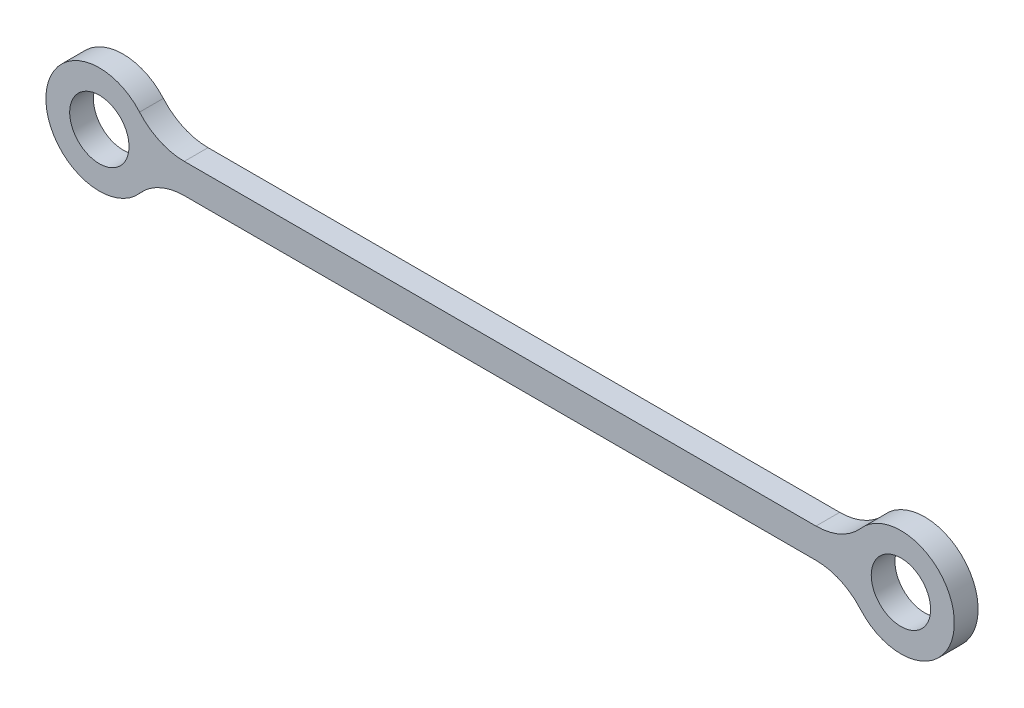
ISO-10303-21;
HEADER;
FILE_DESCRIPTION(('STEP AP214'),'2;1');
FILE_NAME('part.step','',(''),(''),'','','');
FILE_SCHEMA(('AUTOMOTIVE_DESIGN { 1 0 10303 214 1 1 1 1 }'));
ENDSEC;
DATA;
#1=APPLICATION_CONTEXT('core data for automotive mechanical design processes');
#2=APPLICATION_PROTOCOL_DEFINITION('international standard','automotive_design',2000,#1);
#3=PRODUCT_CONTEXT('',#1,'mechanical');
#4=PRODUCT('Part','Part','',(#3));
#5=PRODUCT_RELATED_PRODUCT_CATEGORY('part','',(#4));
#6=PRODUCT_DEFINITION_FORMATION('','',#4);
#7=PRODUCT_DEFINITION_CONTEXT('part definition',#1,'design');
#8=PRODUCT_DEFINITION('design','',#6,#7);
#9=PRODUCT_DEFINITION_SHAPE('','',#8);
#10=(LENGTH_UNIT() NAMED_UNIT(*) SI_UNIT(.MILLI.,.METRE.));
#11=(NAMED_UNIT(*) PLANE_ANGLE_UNIT() SI_UNIT($,.RADIAN.));
#12=(NAMED_UNIT(*) SI_UNIT($,.STERADIAN.) SOLID_ANGLE_UNIT());
#13=UNCERTAINTY_MEASURE_WITH_UNIT(LENGTH_MEASURE(1.E-05),#10,'distance_accuracy_value','');
#14=(GEOMETRIC_REPRESENTATION_CONTEXT(3) GLOBAL_UNCERTAINTY_ASSIGNED_CONTEXT((#13)) GLOBAL_UNIT_ASSIGNED_CONTEXT((#10,
#11,#12)) REPRESENTATION_CONTEXT('',''));
#15=CARTESIAN_POINT('',(0.,0.,0.));
#16=DIRECTION('',(0.,0.,1.));
#17=DIRECTION('',(1.,0.,0.));
#18=AXIS2_PLACEMENT_3D('',#15,#16,#17);
#19=CARTESIAN_POINT('',(-34.4856909477234,-12.5,0.));
#20=DIRECTION('',(0.,0.,-1.));
#21=DIRECTION('',(-1.,0.,0.));
#22=AXIS2_PLACEMENT_3D('',#19,#20,#21);
#23=PLANE('',#22);
#24=CARTESIAN_POINT('',(86.2052210310225,0.,0.));
#25=DIRECTION('',(0.,0.,-1.));
#26=DIRECTION('',(-1.,0.,0.));
#27=AXIS2_PLACEMENT_3D('',#24,#25,#26);
#28=CIRCLE('',#27,5.);
#29=CARTESIAN_POINT('',(81.2052210310225,0.,0.));
#30=VERTEX_POINT('',#29);
#31=EDGE_CURVE('E130',#30,#30,#28,.F.);
#32=ORIENTED_EDGE('',*,*,#31,.T.);
#33=EDGE_LOOP('',(#32));
#34=FACE_BOUND('',#33,.T.);
#35=CARTESIAN_POINT('',(71.8961330097683,-12.5,0.));
#36=DIRECTION('',(0.,0.,-1.));
#37=DIRECTION('',(-1.,0.,0.));
#38=AXIS2_PLACEMENT_3D('',#35,#36,#37);
#39=CIRCLE('',#38,9.99999999999999);
#40=CARTESIAN_POINT('',(79.4272319683231,-5.92105263157895,0.));
#41=VERTEX_POINT('',#40);
#42=CARTESIAN_POINT('',(71.8961330097683,-2.5,0.));
#43=VERTEX_POINT('',#42);
#44=EDGE_CURVE('E134',#41,#43,#39,.F.);
#45=ORIENTED_EDGE('',*,*,#44,.T.);
#46=DIRECTION('',(-1.,0.,0.));
#47=VECTOR('',#46,1.);
#48=CARTESIAN_POINT('',(-34.4856909477234,-2.5,0.));
#49=LINE('',#48,#47);
#50=CARTESIAN_POINT('',(-34.4856909477234,-2.5,0.));
#51=VERTEX_POINT('',#50);
#52=EDGE_CURVE('E105',#43,#51,#49,.T.);
#53=ORIENTED_EDGE('',*,*,#52,.T.);
#54=CARTESIAN_POINT('',(-34.4856909477234,-12.5,0.));
#55=DIRECTION('',(0.,0.,-1.));
#56=DIRECTION('',(-1.,0.,0.));
#57=AXIS2_PLACEMENT_3D('',#54,#55,#56);
#58=CIRCLE('',#57,10.);
#59=CARTESIAN_POINT('',(-42.0167899062782,-5.92105263157895,0.));
#60=VERTEX_POINT('',#59);
#61=EDGE_CURVE('E85',#51,#60,#58,.F.);
#62=ORIENTED_EDGE('',*,*,#61,.T.);
#63=CARTESIAN_POINT('',(-48.7947789689775,0.,0.));
#64=DIRECTION('',(0.,0.,-1.));
#65=DIRECTION('',(-1.,0.,0.));
#66=AXIS2_PLACEMENT_3D('',#63,#64,#65);
#67=CIRCLE('',#66,8.99999999999999);
#68=CARTESIAN_POINT('',(-42.0167899062782,5.92105263157895,0.));
#69=VERTEX_POINT('',#68);
#70=EDGE_CURVE('E80',#69,#60,#67,.F.);
#71=ORIENTED_EDGE('',*,*,#70,.F.);
#72=CARTESIAN_POINT('',(-34.4856909477234,12.5,0.));
#73=DIRECTION('',(0.,0.,-1.));
#74=DIRECTION('',(-1.,0.,0.));
#75=AXIS2_PLACEMENT_3D('',#72,#73,#74);
#76=CIRCLE('',#75,10.);
#77=CARTESIAN_POINT('',(-34.4856909477234,2.5,0.));
#78=VERTEX_POINT('',#77);
#79=EDGE_CURVE('E83',#69,#78,#76,.F.);
#80=ORIENTED_EDGE('',*,*,#79,.T.);
#81=DIRECTION('',(1.,0.,0.));
#82=VECTOR('',#81,1.);
#83=CARTESIAN_POINT('',(-34.4856909477234,2.5,0.));
#84=LINE('',#83,#82);
#85=CARTESIAN_POINT('',(71.8961330097682,2.49999999999998,0.));
#86=VERTEX_POINT('',#85);
#87=EDGE_CURVE('E109',#78,#86,#84,.T.);
#88=ORIENTED_EDGE('',*,*,#87,.T.);
#89=CARTESIAN_POINT('',(71.8961330097682,12.5,0.));
#90=DIRECTION('',(0.,0.,-1.));
#91=DIRECTION('',(-1.,0.,0.));
#92=AXIS2_PLACEMENT_3D('',#89,#90,#91);
#93=CIRCLE('',#92,10.);
#94=CARTESIAN_POINT('',(79.4272319683231,5.92105263157894,0.));
#95=VERTEX_POINT('',#94);
#96=EDGE_CURVE('E140',#86,#95,#93,.F.);
#97=ORIENTED_EDGE('',*,*,#96,.T.);
#98=CARTESIAN_POINT('',(86.2052210310225,0.,0.));
#99=DIRECTION('',(0.,0.,-1.));
#100=DIRECTION('',(-1.,0.,0.));
#101=AXIS2_PLACEMENT_3D('',#98,#99,#100);
#102=CIRCLE('',#101,8.99999999999999);
#103=EDGE_CURVE('E137',#41,#95,#102,.F.);
#104=ORIENTED_EDGE('',*,*,#103,.F.);
#105=EDGE_LOOP('',(#45,#53,#62,#71,#80,#88,#97,#104));
#106=FACE_BOUND('',#105,.T.);
#107=CARTESIAN_POINT('',(-48.7947789689775,0.,0.));
#108=DIRECTION('',(0.,0.,-1.));
#109=DIRECTION('',(-1.,0.,0.));
#110=AXIS2_PLACEMENT_3D('',#107,#108,#109);
#111=CIRCLE('',#110,5.);
#112=CARTESIAN_POINT('',(-53.7947789689775,0.,0.));
#113=VERTEX_POINT('',#112);
#114=EDGE_CURVE('E20',#113,#113,#111,.F.);
#115=ORIENTED_EDGE('',*,*,#114,.T.);
#116=EDGE_LOOP('',(#115));
#117=FACE_BOUND('',#116,.T.);
#118=ADVANCED_FACE('F17',(#34,#106,#117),#23,.T.);
#119=CARTESIAN_POINT('',(-48.7947789689775,0.,4.));
#120=DIRECTION('',(0.,0.,-1.));
#121=DIRECTION('',(-1.,0.,0.));
#122=AXIS2_PLACEMENT_3D('',#119,#120,#121);
#123=CYLINDRICAL_SURFACE('',#122,5.);
#124=ORIENTED_EDGE('',*,*,#114,.F.);
#125=EDGE_LOOP('',(#124));
#126=FACE_BOUND('',#125,.T.);
#127=CARTESIAN_POINT('',(-48.7947789689775,0.,4.));
#128=DIRECTION('',(0.,0.,-1.));
#129=DIRECTION('',(-1.,0.,0.));
#130=AXIS2_PLACEMENT_3D('',#127,#128,#129);
#131=CIRCLE('',#130,5.);
#132=CARTESIAN_POINT('',(-53.7947789689775,0.,4.));
#133=VERTEX_POINT('',#132);
#134=EDGE_CURVE('E127',#133,#133,#131,.F.);
#135=ORIENTED_EDGE('',*,*,#134,.T.);
#136=EDGE_LOOP('',(#135));
#137=FACE_BOUND('',#136,.T.);
#138=ADVANCED_FACE('F265',(#126,#137),#123,.F.);
#139=CARTESIAN_POINT('',(-48.7947789689775,0.,4.));
#140=DIRECTION('',(0.,0.,-1.));
#141=DIRECTION('',(-1.,0.,0.));
#142=AXIS2_PLACEMENT_3D('',#139,#140,#141);
#143=CYLINDRICAL_SURFACE('',#142,8.99999999999999);
#144=DIRECTION('',(0.,0.,-1.));
#145=VECTOR('',#144,1.);
#146=CARTESIAN_POINT('',(-42.0167899062782,5.92105263157895,4.));
#147=LINE('',#146,#145);
#148=CARTESIAN_POINT('',(-42.0167899062782,5.92105263157895,4.));
#149=VERTEX_POINT('',#148);
#150=EDGE_CURVE('E90',#149,#69,#147,.T.);
#151=ORIENTED_EDGE('',*,*,#150,.T.);
#152=ORIENTED_EDGE('',*,*,#70,.T.);
#153=DIRECTION('',(0.,0.,-1.));
#154=VECTOR('',#153,1.);
#155=CARTESIAN_POINT('',(-42.0167899062782,-5.92105263157895,4.));
#156=LINE('',#155,#154);
#157=CARTESIAN_POINT('',(-42.0167899062782,-5.92105263157895,4.));
#158=VERTEX_POINT('',#157);
#159=EDGE_CURVE('E107',#60,#158,#156,.F.);
#160=ORIENTED_EDGE('',*,*,#159,.T.);
#161=CARTESIAN_POINT('',(-48.7947789689775,0.,4.));
#162=DIRECTION('',(0.,0.,-1.));
#163=DIRECTION('',(-1.,0.,0.));
#164=AXIS2_PLACEMENT_3D('',#161,#162,#163);
#165=CIRCLE('',#164,8.99999999999999);
#166=EDGE_CURVE('E100',#158,#149,#165,.T.);
#167=ORIENTED_EDGE('',*,*,#166,.T.);
#168=EDGE_LOOP('',(#151,#152,#160,#167));
#169=FACE_BOUND('',#168,.T.);
#170=ADVANCED_FACE('F99',(#169),#143,.T.);
#171=CARTESIAN_POINT('',(-34.4856909477234,12.5,4.));
#172=DIRECTION('',(0.,0.,-1.));
#173=DIRECTION('',(-1.,0.,0.));
#174=AXIS2_PLACEMENT_3D('',#171,#172,#173);
#175=CYLINDRICAL_SURFACE('',#174,10.);
#176=ORIENTED_EDGE('',*,*,#150,.F.);
#177=CARTESIAN_POINT('',(-34.4856909477234,12.5,4.));
#178=DIRECTION('',(0.,0.,-1.));
#179=DIRECTION('',(-1.,0.,0.));
#180=AXIS2_PLACEMENT_3D('',#177,#178,#179);
#181=CIRCLE('',#180,10.);
#182=CARTESIAN_POINT('',(-34.4856909477234,2.5,4.));
#183=VERTEX_POINT('',#182);
#184=EDGE_CURVE('E124',#149,#183,#181,.F.);
#185=ORIENTED_EDGE('',*,*,#184,.T.);
#186=DIRECTION('',(0.,0.,1.));
#187=VECTOR('',#186,1.);
#188=CARTESIAN_POINT('',(-34.4856909477234,2.5,4.));
#189=LINE('',#188,#187);
#190=EDGE_CURVE('E97',#183,#78,#189,.F.);
#191=ORIENTED_EDGE('',*,*,#190,.T.);
#192=ORIENTED_EDGE('',*,*,#79,.F.);
#193=EDGE_LOOP('',(#176,#185,#191,#192));
#194=FACE_BOUND('',#193,.T.);
#195=ADVANCED_FACE('F94',(#194),#175,.F.);
#196=CARTESIAN_POINT('',(-34.4856909477234,2.5,4.));
#197=DIRECTION('',(0.,-1.,0.));
#198=DIRECTION('',(1.,0.,0.));
#199=AXIS2_PLACEMENT_3D('',#196,#197,#198);
#200=PLANE('',#199);
#201=ORIENTED_EDGE('',*,*,#190,.F.);
#202=DIRECTION('',(-1.,0.,0.));
#203=VECTOR('',#202,1.);
#204=CARTESIAN_POINT('',(-34.4856909477234,2.5,4.));
#205=LINE('',#204,#203);
#206=CARTESIAN_POINT('',(71.8961330097682,2.49999999999998,4.));
#207=VERTEX_POINT('',#206);
#208=EDGE_CURVE('E123',#183,#207,#205,.F.);
#209=ORIENTED_EDGE('',*,*,#208,.T.);
#210=DIRECTION('',(0.,0.,-1.));
#211=VECTOR('',#210,1.);
#212=CARTESIAN_POINT('',(71.8961330097682,2.49999999999996,4.));
#213=LINE('',#212,#211);
#214=EDGE_CURVE('E110',#207,#86,#213,.T.);
#215=ORIENTED_EDGE('',*,*,#214,.T.);
#216=ORIENTED_EDGE('',*,*,#87,.F.);
#217=EDGE_LOOP('',(#201,#209,#215,#216));
#218=FACE_BOUND('',#217,.T.);
#219=ADVANCED_FACE('F176',(#218),#200,.F.);
#220=CARTESIAN_POINT('',(71.8961330097682,12.5,4.));
#221=DIRECTION('',(0.,0.,-1.));
#222=DIRECTION('',(-1.,0.,0.));
#223=AXIS2_PLACEMENT_3D('',#220,#221,#222);
#224=CYLINDRICAL_SURFACE('',#223,10.);
#225=ORIENTED_EDGE('',*,*,#214,.F.);
#226=CARTESIAN_POINT('',(71.8961330097682,12.5,4.));
#227=DIRECTION('',(0.,0.,-1.));
#228=DIRECTION('',(-1.,0.,0.));
#229=AXIS2_PLACEMENT_3D('',#226,#227,#228);
#230=CIRCLE('',#229,10.);
#231=CARTESIAN_POINT('',(79.4272319683231,5.92105263157894,4.));
#232=VERTEX_POINT('',#231);
#233=EDGE_CURVE('E120',#207,#232,#230,.F.);
#234=ORIENTED_EDGE('',*,*,#233,.T.);
#235=DIRECTION('',(0.,0.,-1.));
#236=VECTOR('',#235,1.);
#237=CARTESIAN_POINT('',(79.4272319683231,5.92105263157895,4.));
#238=LINE('',#237,#236);
#239=EDGE_CURVE('E139',#95,#232,#238,.F.);
#240=ORIENTED_EDGE('',*,*,#239,.F.);
#241=ORIENTED_EDGE('',*,*,#96,.F.);
#242=EDGE_LOOP('',(#225,#234,#240,#241));
#243=FACE_BOUND('',#242,.T.);
#244=ADVANCED_FACE('F174',(#243),#224,.F.);
#245=CARTESIAN_POINT('',(86.2052210310225,0.,4.));
#246=DIRECTION('',(0.,0.,-1.));
#247=DIRECTION('',(-1.,0.,0.));
#248=AXIS2_PLACEMENT_3D('',#245,#246,#247);
#249=CYLINDRICAL_SURFACE('',#248,8.99999999999999);
#250=CARTESIAN_POINT('',(86.2052210310225,0.,4.));
#251=DIRECTION('',(0.,0.,-1.));
#252=DIRECTION('',(-1.,0.,0.));
#253=AXIS2_PLACEMENT_3D('',#250,#251,#252);
#254=CIRCLE('',#253,8.99999999999999);
#255=CARTESIAN_POINT('',(79.4272319683231,-5.92105263157895,4.));
#256=VERTEX_POINT('',#255);
#257=EDGE_CURVE('E117',#232,#256,#254,.T.);
#258=ORIENTED_EDGE('',*,*,#257,.T.);
#259=DIRECTION('',(0.,0.,-1.));
#260=VECTOR('',#259,1.);
#261=CARTESIAN_POINT('',(79.4272319683231,-5.92105263157895,4.));
#262=LINE('',#261,#260);
#263=EDGE_CURVE('E136',#256,#41,#262,.T.);
#264=ORIENTED_EDGE('',*,*,#263,.T.);
#265=ORIENTED_EDGE('',*,*,#103,.T.);
#266=ORIENTED_EDGE('',*,*,#239,.T.);
#267=EDGE_LOOP('',(#258,#264,#265,#266));
#268=FACE_BOUND('',#267,.T.);
#269=ADVANCED_FACE('F170',(#268),#249,.T.);
#270=CARTESIAN_POINT('',(71.8961330097683,-12.5,4.));
#271=DIRECTION('',(0.,0.,-1.));
#272=DIRECTION('',(-1.,0.,0.));
#273=AXIS2_PLACEMENT_3D('',#270,#271,#272);
#274=CYLINDRICAL_SURFACE('',#273,9.99999999999999);
#275=ORIENTED_EDGE('',*,*,#263,.F.);
#276=CARTESIAN_POINT('',(71.8961330097683,-12.5,4.));
#277=DIRECTION('',(0.,0.,-1.));
#278=DIRECTION('',(-1.,0.,0.));
#279=AXIS2_PLACEMENT_3D('',#276,#277,#278);
#280=CIRCLE('',#279,9.99999999999999);
#281=CARTESIAN_POINT('',(71.8961330097683,-2.5,4.));
#282=VERTEX_POINT('',#281);
#283=EDGE_CURVE('E114',#256,#282,#280,.F.);
#284=ORIENTED_EDGE('',*,*,#283,.T.);
#285=DIRECTION('',(0.,0.,1.));
#286=VECTOR('',#285,1.);
#287=CARTESIAN_POINT('',(71.8961330097683,-2.5,4.));
#288=LINE('',#287,#286);
#289=EDGE_CURVE('E108',#282,#43,#288,.F.);
#290=ORIENTED_EDGE('',*,*,#289,.T.);
#291=ORIENTED_EDGE('',*,*,#44,.F.);
#292=EDGE_LOOP('',(#275,#284,#290,#291));
#293=FACE_BOUND('',#292,.T.);
#294=ADVANCED_FACE('F167',(#293),#274,.F.);
#295=CARTESIAN_POINT('',(-34.4856909477234,-2.5,4.));
#296=DIRECTION('',(0.,1.,0.));
#297=DIRECTION('',(-1.,0.,0.));
#298=AXIS2_PLACEMENT_3D('',#295,#296,#297);
#299=PLANE('',#298);
#300=ORIENTED_EDGE('',*,*,#289,.F.);
#301=DIRECTION('',(-1.,0.,0.));
#302=VECTOR('',#301,1.);
#303=CARTESIAN_POINT('',(-34.4856909477234,-2.5,4.));
#304=LINE('',#303,#302);
#305=CARTESIAN_POINT('',(-34.4856909477234,-2.5,4.));
#306=VERTEX_POINT('',#305);
#307=EDGE_CURVE('E113',#282,#306,#304,.T.);
#308=ORIENTED_EDGE('',*,*,#307,.T.);
#309=DIRECTION('',(0.,0.,-1.));
#310=VECTOR('',#309,1.);
#311=CARTESIAN_POINT('',(-34.4856909477234,-2.5,4.));
#312=LINE('',#311,#310);
#313=EDGE_CURVE('E35',#306,#51,#312,.T.);
#314=ORIENTED_EDGE('',*,*,#313,.T.);
#315=ORIENTED_EDGE('',*,*,#52,.F.);
#316=EDGE_LOOP('',(#300,#308,#314,#315));
#317=FACE_BOUND('',#316,.T.);
#318=ADVANCED_FACE('F159',(#317),#299,.F.);
#319=CARTESIAN_POINT('',(-34.4856909477234,-12.5,4.));
#320=DIRECTION('',(0.,0.,-1.));
#321=DIRECTION('',(-1.,0.,0.));
#322=AXIS2_PLACEMENT_3D('',#319,#320,#321);
#323=CYLINDRICAL_SURFACE('',#322,10.);
#324=ORIENTED_EDGE('',*,*,#313,.F.);
#325=CARTESIAN_POINT('',(-34.4856909477234,-12.5,4.));
#326=DIRECTION('',(0.,0.,-1.));
#327=DIRECTION('',(-1.,0.,0.));
#328=AXIS2_PLACEMENT_3D('',#325,#326,#327);
#329=CIRCLE('',#328,10.);
#330=EDGE_CURVE('E26',#306,#158,#329,.F.);
#331=ORIENTED_EDGE('',*,*,#330,.T.);
#332=ORIENTED_EDGE('',*,*,#159,.F.);
#333=ORIENTED_EDGE('',*,*,#61,.F.);
#334=EDGE_LOOP('',(#324,#331,#332,#333));
#335=FACE_BOUND('',#334,.T.);
#336=ADVANCED_FACE('F192',(#335),#323,.F.);
#337=CARTESIAN_POINT('',(86.2052210310225,0.,4.));
#338=DIRECTION('',(0.,0.,-1.));
#339=DIRECTION('',(-1.,0.,0.));
#340=AXIS2_PLACEMENT_3D('',#337,#338,#339);
#341=CYLINDRICAL_SURFACE('',#340,5.);
#342=ORIENTED_EDGE('',*,*,#31,.F.);
#343=EDGE_LOOP('',(#342));
#344=FACE_BOUND('',#343,.T.);
#345=CARTESIAN_POINT('',(86.2052210310225,0.,4.));
#346=DIRECTION('',(0.,0.,-1.));
#347=DIRECTION('',(-1.,0.,0.));
#348=AXIS2_PLACEMENT_3D('',#345,#346,#347);
#349=CIRCLE('',#348,5.);
#350=CARTESIAN_POINT('',(81.2052210310225,0.,4.));
#351=VERTEX_POINT('',#350);
#352=EDGE_CURVE('E11',#351,#351,#349,.F.);
#353=ORIENTED_EDGE('',*,*,#352,.T.);
#354=EDGE_LOOP('',(#353));
#355=FACE_BOUND('',#354,.T.);
#356=ADVANCED_FACE('F186',(#344,#355),#341,.F.);
#357=CARTESIAN_POINT('',(-34.4856909477234,-12.5,4.));
#358=DIRECTION('',(0.,0.,-1.));
#359=DIRECTION('',(-1.,0.,0.));
#360=AXIS2_PLACEMENT_3D('',#357,#358,#359);
#361=PLANE('',#360);
#362=ORIENTED_EDGE('',*,*,#352,.F.);
#363=EDGE_LOOP('',(#362));
#364=FACE_BOUND('',#363,.T.);
#365=ORIENTED_EDGE('',*,*,#307,.F.);
#366=ORIENTED_EDGE('',*,*,#283,.F.);
#367=ORIENTED_EDGE('',*,*,#257,.F.);
#368=ORIENTED_EDGE('',*,*,#233,.F.);
#369=ORIENTED_EDGE('',*,*,#208,.F.);
#370=ORIENTED_EDGE('',*,*,#184,.F.);
#371=ORIENTED_EDGE('',*,*,#166,.F.);
#372=ORIENTED_EDGE('',*,*,#330,.F.);
#373=EDGE_LOOP('',(#365,#366,#367,#368,#369,#370,#371,#372));
#374=FACE_BOUND('',#373,.T.);
#375=ORIENTED_EDGE('',*,*,#134,.F.);
#376=EDGE_LOOP('',(#375));
#377=FACE_BOUND('',#376,.T.);
#378=ADVANCED_FACE('F163',(#364,#374,#377),#361,.F.);
#379=CLOSED_SHELL('',(#118,#138,#170,#195,#219,#244,#269,#294,#318,#336,#356,#378));
#380=MANIFOLD_SOLID_BREP('B1',#379);
#381=ADVANCED_BREP_SHAPE_REPRESENTATION('',(#18,#380),#14);
#382=SHAPE_DEFINITION_REPRESENTATION(#9,#381);
ENDSEC;
END-ISO-10303-21;
